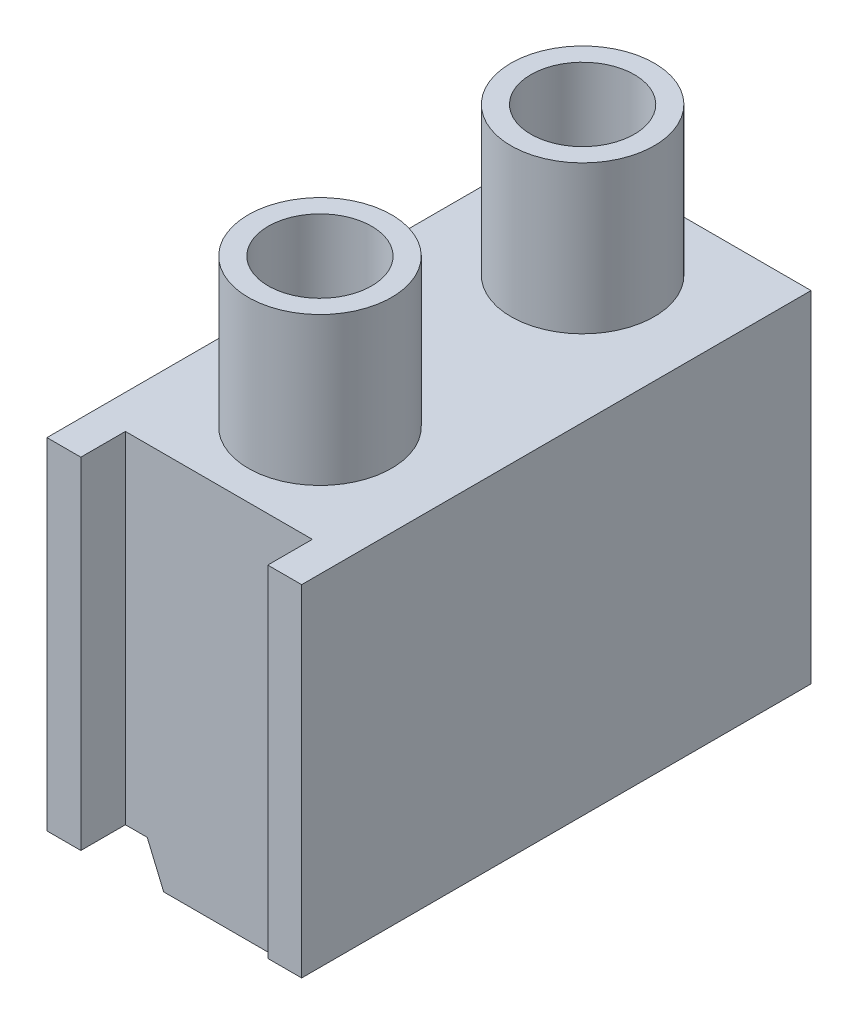
ISO-10303-21;
HEADER;
FILE_DESCRIPTION(('STEP AP214'),'2;1');
FILE_NAME('part.step','',(''),(''),'','','');
FILE_SCHEMA(('AUTOMOTIVE_DESIGN { 1 0 10303 214 1 1 1 1 }'));
ENDSEC;
DATA;
#1=APPLICATION_CONTEXT('core data for automotive mechanical design processes');
#2=APPLICATION_PROTOCOL_DEFINITION('international standard','automotive_design',2000,#1);
#3=PRODUCT_CONTEXT('',#1,'mechanical');
#4=PRODUCT('Part','Part','',(#3));
#5=PRODUCT_RELATED_PRODUCT_CATEGORY('part','',(#4));
#6=PRODUCT_DEFINITION_FORMATION('','',#4);
#7=PRODUCT_DEFINITION_CONTEXT('part definition',#1,'design');
#8=PRODUCT_DEFINITION('design','',#6,#7);
#9=PRODUCT_DEFINITION_SHAPE('','',#8);
#10=(LENGTH_UNIT() NAMED_UNIT(*) SI_UNIT(.MILLI.,.METRE.));
#11=(NAMED_UNIT(*) PLANE_ANGLE_UNIT() SI_UNIT($,.RADIAN.));
#12=(NAMED_UNIT(*) SI_UNIT($,.STERADIAN.) SOLID_ANGLE_UNIT());
#13=UNCERTAINTY_MEASURE_WITH_UNIT(LENGTH_MEASURE(1.E-05),#10,'distance_accuracy_value','');
#14=(GEOMETRIC_REPRESENTATION_CONTEXT(3) GLOBAL_UNCERTAINTY_ASSIGNED_CONTEXT((#13)) GLOBAL_UNIT_ASSIGNED_CONTEXT((#10,
#11,#12)) REPRESENTATION_CONTEXT('',''));
#15=CARTESIAN_POINT('',(0.,0.,0.));
#16=DIRECTION('',(0.,0.,1.));
#17=DIRECTION('',(1.,0.,0.));
#18=AXIS2_PLACEMENT_3D('',#15,#16,#17);
#19=CARTESIAN_POINT('',(0.,0.,32.));
#20=DIRECTION('',(0.,0.,1.));
#21=DIRECTION('',(1.,0.,0.));
#22=AXIS2_PLACEMENT_3D('',#19,#20,#21);
#23=PLANE('',#22);
#24=DIRECTION('',(0.,-1.,0.));
#25=VECTOR('',#24,1.);
#26=CARTESIAN_POINT('',(-13.87111125249,-113.2078554853,32.));
#27=LINE('',#26,#25);
#28=CARTESIAN_POINT('',(-13.87111125249,-113.2078554853,32.));
#29=VERTEX_POINT('',#28);
#30=CARTESIAN_POINT('',(-13.87111125249,-134.6078554853,32.));
#31=VERTEX_POINT('',#30);
#32=EDGE_CURVE('E25',#29,#31,#27,.T.);
#33=ORIENTED_EDGE('',*,*,#32,.F.);
#34=DIRECTION('',(-1.,0.,0.));
#35=VECTOR('',#34,1.);
#36=CARTESIAN_POINT('',(-13.87111125249,-113.2078554853,32.));
#37=LINE('',#36,#35);
#38=CARTESIAN_POINT('',(-16.,-113.2078554853,32.));
#39=VERTEX_POINT('',#38);
#40=EDGE_CURVE('E334',#29,#39,#37,.T.);
#41=ORIENTED_EDGE('',*,*,#40,.T.);
#42=DIRECTION('',(0.,-1.,0.));
#43=VECTOR('',#42,1.);
#44=CARTESIAN_POINT('',(-16.,-113.2078554853,32.));
#45=LINE('',#44,#43);
#46=CARTESIAN_POINT('',(-16.,-134.6078554853,32.));
#47=VERTEX_POINT('',#46);
#48=EDGE_CURVE('E37',#39,#47,#45,.T.);
#49=ORIENTED_EDGE('',*,*,#48,.T.);
#50=DIRECTION('',(1.,0.,0.));
#51=VECTOR('',#50,1.);
#52=CARTESIAN_POINT('',(-16.,-134.6078554853,32.));
#53=LINE('',#52,#51);
#54=EDGE_CURVE('E319',#47,#31,#53,.T.);
#55=ORIENTED_EDGE('',*,*,#54,.T.);
#56=EDGE_LOOP('',(#33,#41,#49,#55));
#57=FACE_BOUND('',#56,.T.);
#58=ADVANCED_FACE('F17',(#57),#23,.T.);
#59=CARTESIAN_POINT('',(0.,0.,32.));
#60=DIRECTION('',(0.,0.,1.));
#61=DIRECTION('',(1.,0.,0.));
#62=AXIS2_PLACEMENT_3D('',#59,#60,#61);
#63=PLANE('',#62);
#64=DIRECTION('',(0.,1.,0.));
#65=VECTOR('',#64,1.);
#66=CARTESIAN_POINT('',(-2.128888747504,-134.6078554853,32.));
#67=LINE('',#66,#65);
#68=CARTESIAN_POINT('',(-2.128888747504,-134.6078554853,32.));
#69=VERTEX_POINT('',#68);
#70=CARTESIAN_POINT('',(-2.128888747504,-113.2078554853,32.));
#71=VERTEX_POINT('',#70);
#72=EDGE_CURVE('E11',#69,#71,#67,.T.);
#73=ORIENTED_EDGE('',*,*,#72,.F.);
#74=DIRECTION('',(1.,0.,0.));
#75=VECTOR('',#74,1.);
#76=CARTESIAN_POINT('',(-2.128888747504,-134.6078554853,32.));
#77=LINE('',#76,#75);
#78=CARTESIAN_POINT('',(0.,-134.6078554853,32.));
#79=VERTEX_POINT('',#78);
#80=EDGE_CURVE('E350',#69,#79,#77,.T.);
#81=ORIENTED_EDGE('',*,*,#80,.T.);
#82=DIRECTION('',(0.,1.,0.));
#83=VECTOR('',#82,1.);
#84=CARTESIAN_POINT('',(0.,-134.6078554853,32.));
#85=LINE('',#84,#83);
#86=CARTESIAN_POINT('',(0.,-113.2078554853,32.));
#87=VERTEX_POINT('',#86);
#88=EDGE_CURVE('E340',#79,#87,#85,.T.);
#89=ORIENTED_EDGE('',*,*,#88,.T.);
#90=DIRECTION('',(-1.,0.,0.));
#91=VECTOR('',#90,1.);
#92=CARTESIAN_POINT('',(0.,-113.2078554853,32.));
#93=LINE('',#92,#91);
#94=EDGE_CURVE('E322',#87,#71,#93,.T.);
#95=ORIENTED_EDGE('',*,*,#94,.T.);
#96=EDGE_LOOP('',(#73,#81,#89,#95));
#97=FACE_BOUND('',#96,.T.);
#98=ADVANCED_FACE('F695',(#97),#63,.T.);
#99=CARTESIAN_POINT('',(-2.128888747504,-143.2078554853,32.));
#100=DIRECTION('',(1.,0.,0.));
#101=DIRECTION('',(0.,1.,0.));
#102=AXIS2_PLACEMENT_3D('',#99,#100,#101);
#103=PLANE('',#102);
#104=DIRECTION('',(0.,0.,-1.));
#105=VECTOR('',#104,1.);
#106=CARTESIAN_POINT('',(-2.128888747504,-113.2078554853,32.));
#107=LINE('',#106,#105);
#108=CARTESIAN_POINT('',(-2.128888747504,-113.2078554853,29.2));
#109=VERTEX_POINT('',#108);
#110=EDGE_CURVE('E227',#71,#109,#107,.T.);
#111=ORIENTED_EDGE('',*,*,#110,.T.);
#112=DIRECTION('',(0.,1.,0.));
#113=VECTOR('',#112,1.);
#114=CARTESIAN_POINT('',(-2.128888747504,-134.6078554853,29.2));
#115=LINE('',#114,#113);
#116=CARTESIAN_POINT('',(-2.128888747504,-134.6078554853,29.2));
#117=VERTEX_POINT('',#116);
#118=EDGE_CURVE('E228',#117,#109,#115,.T.);
#119=ORIENTED_EDGE('',*,*,#118,.F.);
#120=DIRECTION('',(0.,0.,1.));
#121=VECTOR('',#120,1.);
#122=CARTESIAN_POINT('',(-2.128888747504,-134.6078554853,29.2));
#123=LINE('',#122,#121);
#124=EDGE_CURVE('E353',#117,#69,#123,.T.);
#125=ORIENTED_EDGE('',*,*,#124,.T.);
#126=ORIENTED_EDGE('',*,*,#72,.T.);
#127=EDGE_LOOP('',(#111,#119,#125,#126));
#128=FACE_BOUND('',#127,.T.);
#129=ADVANCED_FACE('F685',(#128),#103,.F.);
#130=CARTESIAN_POINT('',(-13.87111125249,-143.2078554853,29.2));
#131=DIRECTION('',(-1.,0.,0.));
#132=DIRECTION('',(0.,0.,1.));
#133=AXIS2_PLACEMENT_3D('',#130,#131,#132);
#134=PLANE('',#133);
#135=DIRECTION('',(0.,0.,1.));
#136=VECTOR('',#135,1.);
#137=CARTESIAN_POINT('',(-13.87111125249,-113.2078554853,29.2));
#138=LINE('',#137,#136);
#139=CARTESIAN_POINT('',(-13.87111125249,-113.2078554853,29.2));
#140=VERTEX_POINT('',#139);
#141=EDGE_CURVE('E337',#140,#29,#138,.T.);
#142=ORIENTED_EDGE('',*,*,#141,.T.);
#143=ORIENTED_EDGE('',*,*,#32,.T.);
#144=DIRECTION('',(0.,0.,-1.));
#145=VECTOR('',#144,1.);
#146=CARTESIAN_POINT('',(-13.87111125249,-134.6078554853,32.));
#147=LINE('',#146,#145);
#148=CARTESIAN_POINT('',(-13.87111125249,-134.6078554853,29.2));
#149=VERTEX_POINT('',#148);
#150=EDGE_CURVE('E346',#31,#149,#147,.T.);
#151=ORIENTED_EDGE('',*,*,#150,.T.);
#152=DIRECTION('',(0.,1.,0.));
#153=VECTOR('',#152,1.);
#154=CARTESIAN_POINT('',(-13.87111125249,-134.6078554853,29.2));
#155=LINE('',#154,#153);
#156=EDGE_CURVE('E234',#149,#140,#155,.T.);
#157=ORIENTED_EDGE('',*,*,#156,.T.);
#158=EDGE_LOOP('',(#142,#143,#151,#157));
#159=FACE_BOUND('',#158,.T.);
#160=ADVANCED_FACE('F675',(#159),#134,.F.);
#161=CARTESIAN_POINT('',(-16.,-113.2078554853,0.));
#162=DIRECTION('',(-1.,0.,0.));
#163=DIRECTION('',(0.,0.,1.));
#164=AXIS2_PLACEMENT_3D('',#161,#162,#163);
#165=PLANE('',#164);
#166=DIRECTION('',(0.,-1.,0.));
#167=VECTOR('',#166,1.);
#168=CARTESIAN_POINT('',(-16.,-113.2078554853,0.));
#169=LINE('',#168,#167);
#170=CARTESIAN_POINT('',(-16.,-113.2078554853,0.));
#171=VERTEX_POINT('',#170);
#172=CARTESIAN_POINT('',(-16.,-134.6078554853,0.));
#173=VERTEX_POINT('',#172);
#174=EDGE_CURVE('E285',#171,#173,#169,.T.);
#175=ORIENTED_EDGE('',*,*,#174,.T.);
#176=DIRECTION('',(0.,0.,1.));
#177=VECTOR('',#176,1.);
#178=CARTESIAN_POINT('',(-16.,-134.6078554853,0.));
#179=LINE('',#178,#177);
#180=EDGE_CURVE('E190',#173,#47,#179,.T.);
#181=ORIENTED_EDGE('',*,*,#180,.T.);
#182=ORIENTED_EDGE('',*,*,#48,.F.);
#183=DIRECTION('',(0.,0.,1.));
#184=VECTOR('',#183,1.);
#185=CARTESIAN_POINT('',(-16.,-113.2078554853,0.));
#186=LINE('',#185,#184);
#187=EDGE_CURVE('E330',#171,#39,#186,.T.);
#188=ORIENTED_EDGE('',*,*,#187,.F.);
#189=EDGE_LOOP('',(#175,#181,#182,#188));
#190=FACE_BOUND('',#189,.T.);
#191=ADVANCED_FACE('F665',(#190),#165,.T.);
#192=CARTESIAN_POINT('',(-16.,-134.6078554853,0.));
#193=DIRECTION('',(0.,-1.,0.));
#194=DIRECTION('',(0.,0.,-1.));
#195=AXIS2_PLACEMENT_3D('',#192,#193,#194);
#196=PLANE('',#195);
#197=DIRECTION('',(0.,0.,-1.));
#198=VECTOR('',#197,1.);
#199=CARTESIAN_POINT('',(-12.50098616425,-134.6078554853,29.2));
#200=LINE('',#199,#198);
#201=CARTESIAN_POINT('',(-12.50098616425,-134.6078554853,29.2));
#202=VERTEX_POINT('',#201);
#203=CARTESIAN_POINT('',(-12.50098616425,-134.6078554853,0.));
#204=VERTEX_POINT('',#203);
#205=EDGE_CURVE('E224',#202,#204,#200,.T.);
#206=ORIENTED_EDGE('',*,*,#205,.F.);
#207=DIRECTION('',(1.,0.,0.));
#208=VECTOR('',#207,1.);
#209=CARTESIAN_POINT('',(-13.87111125249,-134.6078554853,29.2));
#210=LINE('',#209,#208);
#211=EDGE_CURVE('E229',#149,#202,#210,.T.);
#212=ORIENTED_EDGE('',*,*,#211,.F.);
#213=ORIENTED_EDGE('',*,*,#150,.F.);
#214=ORIENTED_EDGE('',*,*,#54,.F.);
#215=ORIENTED_EDGE('',*,*,#180,.F.);
#216=DIRECTION('',(1.,0.,0.));
#217=VECTOR('',#216,1.);
#218=CARTESIAN_POINT('',(-16.,-134.6078554853,0.));
#219=LINE('',#218,#217);
#220=EDGE_CURVE('E281',#173,#204,#219,.T.);
#221=ORIENTED_EDGE('',*,*,#220,.T.);
#222=EDGE_LOOP('',(#206,#212,#213,#214,#215,#221));
#223=FACE_BOUND('',#222,.T.);
#224=ADVANCED_FACE('F654',(#223),#196,.T.);
#225=CARTESIAN_POINT('',(-16.,-134.6078554853,0.));
#226=DIRECTION('',(0.,-1.,0.));
#227=DIRECTION('',(0.,0.,-1.));
#228=AXIS2_PLACEMENT_3D('',#225,#226,#227);
#229=PLANE('',#228);
#230=DIRECTION('',(0.,0.,1.));
#231=VECTOR('',#230,1.);
#232=CARTESIAN_POINT('',(-3.499013835749,-134.6078554853,0.));
#233=LINE('',#232,#231);
#234=CARTESIAN_POINT('',(-3.499013835749,-134.6078554853,0.));
#235=VERTEX_POINT('',#234);
#236=CARTESIAN_POINT('',(-3.499013835749,-134.6078554853,29.2));
#237=VERTEX_POINT('',#236);
#238=EDGE_CURVE('E297',#235,#237,#233,.T.);
#239=ORIENTED_EDGE('',*,*,#238,.F.);
#240=DIRECTION('',(1.,0.,0.));
#241=VECTOR('',#240,1.);
#242=CARTESIAN_POINT('',(-3.499013835749,-134.6078554853,0.));
#243=LINE('',#242,#241);
#244=CARTESIAN_POINT('',(0.,-134.6078554853,0.));
#245=VERTEX_POINT('',#244);
#246=EDGE_CURVE('E263',#235,#245,#243,.T.);
#247=ORIENTED_EDGE('',*,*,#246,.T.);
#248=DIRECTION('',(0.,0.,1.));
#249=VECTOR('',#248,1.);
#250=CARTESIAN_POINT('',(0.,-134.6078554853,0.));
#251=LINE('',#250,#249);
#252=EDGE_CURVE('E343',#245,#79,#251,.T.);
#253=ORIENTED_EDGE('',*,*,#252,.T.);
#254=ORIENTED_EDGE('',*,*,#80,.F.);
#255=ORIENTED_EDGE('',*,*,#124,.F.);
#256=DIRECTION('',(1.,0.,0.));
#257=VECTOR('',#256,1.);
#258=CARTESIAN_POINT('',(-3.499013835749,-134.6078554853,29.2));
#259=LINE('',#258,#257);
#260=EDGE_CURVE('E310',#237,#117,#259,.T.);
#261=ORIENTED_EDGE('',*,*,#260,.F.);
#262=EDGE_LOOP('',(#239,#247,#253,#254,#255,#261));
#263=FACE_BOUND('',#262,.T.);
#264=ADVANCED_FACE('F644',(#263),#229,.T.);
#265=CARTESIAN_POINT('',(0.,-134.6078554853,0.));
#266=DIRECTION('',(1.,0.,0.));
#267=DIRECTION('',(0.,-1.,0.));
#268=AXIS2_PLACEMENT_3D('',#265,#266,#267);
#269=PLANE('',#268);
#270=DIRECTION('',(0.,1.,0.));
#271=VECTOR('',#270,1.);
#272=CARTESIAN_POINT('',(0.,-134.6078554853,0.));
#273=LINE('',#272,#271);
#274=CARTESIAN_POINT('',(0.,-113.2078554853,0.));
#275=VERTEX_POINT('',#274);
#276=EDGE_CURVE('E256',#245,#275,#273,.T.);
#277=ORIENTED_EDGE('',*,*,#276,.T.);
#278=DIRECTION('',(0.,0.,1.));
#279=VECTOR('',#278,1.);
#280=CARTESIAN_POINT('',(0.,-113.2078554853,0.));
#281=LINE('',#280,#279);
#282=EDGE_CURVE('E326',#275,#87,#281,.T.);
#283=ORIENTED_EDGE('',*,*,#282,.T.);
#284=ORIENTED_EDGE('',*,*,#88,.F.);
#285=ORIENTED_EDGE('',*,*,#252,.F.);
#286=EDGE_LOOP('',(#277,#283,#284,#285));
#287=FACE_BOUND('',#286,.T.);
#288=ADVANCED_FACE('F632',(#287),#269,.T.);
#289=CARTESIAN_POINT('',(0.,-113.2078554853,0.));
#290=DIRECTION('',(0.,1.,0.));
#291=DIRECTION('',(1.,0.,0.));
#292=AXIS2_PLACEMENT_3D('',#289,#290,#291);
#293=PLANE('',#292);
#294=CARTESIAN_POINT('',(-8.,-113.2078554853,22.85));
#295=DIRECTION('',(0.,1.,0.));
#296=DIRECTION('',(-1.,0.,0.));
#297=AXIS2_PLACEMENT_3D('',#294,#295,#296);
#298=CIRCLE('',#297,4.5);
#299=CARTESIAN_POINT('',(-12.5,-113.2078554853,22.85));
#300=VERTEX_POINT('',#299);
#301=EDGE_CURVE('E171',#300,#300,#298,.T.);
#302=ORIENTED_EDGE('',*,*,#301,.F.);
#303=EDGE_LOOP('',(#302));
#304=FACE_BOUND('',#303,.T.);
#305=CARTESIAN_POINT('',(-8.,-113.2078554853,6.35));
#306=DIRECTION('',(0.,1.,0.));
#307=DIRECTION('',(-1.,0.,0.));
#308=AXIS2_PLACEMENT_3D('',#305,#306,#307);
#309=CIRCLE('',#308,4.5);
#310=CARTESIAN_POINT('',(-12.5,-113.2078554853,6.35));
#311=VERTEX_POINT('',#310);
#312=EDGE_CURVE('E250',#311,#311,#309,.T.);
#313=ORIENTED_EDGE('',*,*,#312,.F.);
#314=EDGE_LOOP('',(#313));
#315=FACE_BOUND('',#314,.T.);
#316=ORIENTED_EDGE('',*,*,#110,.F.);
#317=ORIENTED_EDGE('',*,*,#94,.F.);
#318=ORIENTED_EDGE('',*,*,#282,.F.);
#319=DIRECTION('',(-1.,0.,0.));
#320=VECTOR('',#319,1.);
#321=CARTESIAN_POINT('',(0.,-113.2078554853,0.));
#322=LINE('',#321,#320);
#323=EDGE_CURVE('E293',#275,#171,#322,.T.);
#324=ORIENTED_EDGE('',*,*,#323,.T.);
#325=ORIENTED_EDGE('',*,*,#187,.T.);
#326=ORIENTED_EDGE('',*,*,#40,.F.);
#327=ORIENTED_EDGE('',*,*,#141,.F.);
#328=DIRECTION('',(-1.,0.,0.));
#329=VECTOR('',#328,1.);
#330=CARTESIAN_POINT('',(-2.128888747504,-113.2078554853,29.2));
#331=LINE('',#330,#329);
#332=EDGE_CURVE('E289',#109,#140,#331,.T.);
#333=ORIENTED_EDGE('',*,*,#332,.F.);
#334=EDGE_LOOP('',(#316,#317,#318,#324,#325,#326,#327,#333));
#335=FACE_BOUND('',#334,.T.);
#336=ADVANCED_FACE('F620',(#304,#315,#335),#293,.T.);
#337=CARTESIAN_POINT('',(-12.50098616425,-134.6078554853,-1.));
#338=DIRECTION('',(-0.921115827107869,-0.389288624353945,0.));
#339=DIRECTION('',(-0.389288624353945,0.921115827107869,0.));
#340=AXIS2_PLACEMENT_3D('',#337,#338,#339);
#341=PLANE('',#340);
#342=ORIENTED_EDGE('',*,*,#205,.T.);
#343=DIRECTION('',(0.389288624353945,-0.921115827107869,0.));
#344=VECTOR('',#343,1.);
#345=CARTESIAN_POINT('',(-12.50098616425,-134.6078554853,0.));
#346=LINE('',#345,#344);
#347=CARTESIAN_POINT('',(-11.46554946715,-137.0578554853,0.));
#348=VERTEX_POINT('',#347);
#349=EDGE_CURVE('E262',#204,#348,#346,.T.);
#350=ORIENTED_EDGE('',*,*,#349,.T.);
#351=DIRECTION('',(0.,0.,1.));
#352=VECTOR('',#351,1.);
#353=CARTESIAN_POINT('',(-11.46554946715,-137.0578554853,0.));
#354=LINE('',#353,#352);
#355=CARTESIAN_POINT('',(-11.46554946715,-137.0578554853,29.2));
#356=VERTEX_POINT('',#355);
#357=EDGE_CURVE('E211',#348,#356,#354,.T.);
#358=ORIENTED_EDGE('',*,*,#357,.T.);
#359=DIRECTION('',(0.389288624353945,-0.921115827107869,0.));
#360=VECTOR('',#359,1.);
#361=CARTESIAN_POINT('',(-12.50098616425,-134.6078554853,29.2));
#362=LINE('',#361,#360);
#363=EDGE_CURVE('E233',#202,#356,#362,.T.);
#364=ORIENTED_EDGE('',*,*,#363,.F.);
#365=EDGE_LOOP('',(#342,#350,#358,#364));
#366=FACE_BOUND('',#365,.T.);
#367=ADVANCED_FACE('F609',(#366),#341,.T.);
#368=CARTESIAN_POINT('',(-2.128888747504,-143.2078554853,29.2));
#369=DIRECTION('',(0.,0.,-1.));
#370=DIRECTION('',(0.,-1.,0.));
#371=AXIS2_PLACEMENT_3D('',#368,#369,#370);
#372=PLANE('',#371);
#373=ORIENTED_EDGE('',*,*,#332,.T.);
#374=ORIENTED_EDGE('',*,*,#156,.F.);
#375=ORIENTED_EDGE('',*,*,#211,.T.);
#376=ORIENTED_EDGE('',*,*,#363,.T.);
#377=DIRECTION('',(1.,0.,0.));
#378=VECTOR('',#377,1.);
#379=CARTESIAN_POINT('',(-11.46554946715,-137.0578554853,29.2));
#380=LINE('',#379,#378);
#381=CARTESIAN_POINT('',(-4.53445053285,-137.0578554853,29.2));
#382=VERTEX_POINT('',#381);
#383=EDGE_CURVE('E223',#356,#382,#380,.T.);
#384=ORIENTED_EDGE('',*,*,#383,.T.);
#385=DIRECTION('',(0.389288624353945,0.921115827107869,0.));
#386=VECTOR('',#385,1.);
#387=CARTESIAN_POINT('',(-4.53445053285,-137.0578554853,29.2));
#388=LINE('',#387,#386);
#389=EDGE_CURVE('E301',#382,#237,#388,.T.);
#390=ORIENTED_EDGE('',*,*,#389,.T.);
#391=ORIENTED_EDGE('',*,*,#260,.T.);
#392=ORIENTED_EDGE('',*,*,#118,.T.);
#393=EDGE_LOOP('',(#373,#374,#375,#376,#384,#390,#391,#392));
#394=FACE_BOUND('',#393,.T.);
#395=ADVANCED_FACE('F598',(#394),#372,.F.);
#396=CARTESIAN_POINT('',(-4.53445053285,-137.0578554853,-1.));
#397=DIRECTION('',(0.921115827107869,-0.389288624353945,0.));
#398=DIRECTION('',(0.,0.,-1.));
#399=AXIS2_PLACEMENT_3D('',#396,#397,#398);
#400=PLANE('',#399);
#401=ORIENTED_EDGE('',*,*,#238,.T.);
#402=ORIENTED_EDGE('',*,*,#389,.F.);
#403=DIRECTION('',(0.,0.,1.));
#404=VECTOR('',#403,1.);
#405=CARTESIAN_POINT('',(-4.53445053285,-137.0578554853,0.));
#406=LINE('',#405,#404);
#407=CARTESIAN_POINT('',(-4.53445053285,-137.0578554853,0.));
#408=VERTEX_POINT('',#407);
#409=EDGE_CURVE('E219',#408,#382,#406,.T.);
#410=ORIENTED_EDGE('',*,*,#409,.F.);
#411=DIRECTION('',(0.389288624353945,0.921115827107869,0.));
#412=VECTOR('',#411,1.);
#413=CARTESIAN_POINT('',(-4.53445053285,-137.0578554853,0.));
#414=LINE('',#413,#412);
#415=EDGE_CURVE('E258',#408,#235,#414,.T.);
#416=ORIENTED_EDGE('',*,*,#415,.T.);
#417=EDGE_LOOP('',(#401,#402,#410,#416));
#418=FACE_BOUND('',#417,.T.);
#419=ADVANCED_FACE('F587',(#418),#400,.T.);
#420=CARTESIAN_POINT('',(0.,0.,0.));
#421=DIRECTION('',(0.,0.,1.));
#422=DIRECTION('',(1.,0.,0.));
#423=AXIS2_PLACEMENT_3D('',#420,#421,#422);
#424=PLANE('',#423);
#425=ORIENTED_EDGE('',*,*,#276,.F.);
#426=ORIENTED_EDGE('',*,*,#246,.F.);
#427=ORIENTED_EDGE('',*,*,#415,.F.);
#428=DIRECTION('',(1.,0.,0.));
#429=VECTOR('',#428,1.);
#430=CARTESIAN_POINT('',(-11.46554946715,-137.0578554853,0.));
#431=LINE('',#430,#429);
#432=EDGE_CURVE('E215',#348,#408,#431,.T.);
#433=ORIENTED_EDGE('',*,*,#432,.F.);
#434=ORIENTED_EDGE('',*,*,#349,.F.);
#435=ORIENTED_EDGE('',*,*,#220,.F.);
#436=ORIENTED_EDGE('',*,*,#174,.F.);
#437=ORIENTED_EDGE('',*,*,#323,.F.);
#438=EDGE_LOOP('',(#425,#426,#427,#433,#434,#435,#436,#437));
#439=FACE_BOUND('',#438,.T.);
#440=ADVANCED_FACE('F577',(#439),#424,.F.);
#441=CARTESIAN_POINT('',(-8.,-113.2078554853,6.35));
#442=DIRECTION('',(0.,1.,0.));
#443=DIRECTION('',(-1.,0.,0.));
#444=AXIS2_PLACEMENT_3D('',#441,#442,#443);
#445=CYLINDRICAL_SURFACE('',#444,4.5);
#446=CARTESIAN_POINT('',(-8.,-103.9078554853,6.35));
#447=DIRECTION('',(0.,1.,0.));
#448=DIRECTION('',(-1.,0.,0.));
#449=AXIS2_PLACEMENT_3D('',#446,#447,#448);
#450=CIRCLE('',#449,4.5);
#451=CARTESIAN_POINT('',(-12.5,-103.9078554853,6.35));
#452=VERTEX_POINT('',#451);
#453=EDGE_CURVE('E185',#452,#452,#450,.T.);
#454=ORIENTED_EDGE('',*,*,#453,.F.);
#455=CARTESIAN_POINT('',(-12.5,-113.2078554853,6.35));
#456=CARTESIAN_POINT('',(-12.5,-103.9078554853,6.35));
#457=(BOUNDED_CURVE() B_SPLINE_CURVE(1,(#455,#456),.UNSPECIFIED.,.F.,
.F.) B_SPLINE_CURVE_WITH_KNOTS((2,2),(0.,9.3),
.UNSPECIFIED.) CURVE() GEOMETRIC_REPRESENTATION_ITEM() RATIONAL_B_SPLINE_CURVE((1.,1.)) REPRESENTATION_ITEM(''));
#458=EDGE_CURVE('E257',#311,#452,#457,.T.);
#459=ORIENTED_EDGE('',*,*,#458,.F.);
#460=ORIENTED_EDGE('',*,*,#312,.T.);
#461=ORIENTED_EDGE('',*,*,#458,.T.);
#462=EDGE_LOOP('',(#454,#459,#460,#461));
#463=FACE_BOUND('',#462,.T.);
#464=ADVANCED_FACE('F567',(#463),#445,.T.);
#465=CARTESIAN_POINT('',(-8.,-113.2078554853,22.85));
#466=DIRECTION('',(0.,1.,0.));
#467=DIRECTION('',(-1.,0.,0.));
#468=AXIS2_PLACEMENT_3D('',#465,#466,#467);
#469=CYLINDRICAL_SURFACE('',#468,4.5);
#470=CARTESIAN_POINT('',(-8.,-103.9078554853,22.85));
#471=DIRECTION('',(0.,1.,0.));
#472=DIRECTION('',(-1.,0.,0.));
#473=AXIS2_PLACEMENT_3D('',#470,#471,#472);
#474=CIRCLE('',#473,4.5);
#475=CARTESIAN_POINT('',(-12.5,-103.9078554853,22.85));
#476=VERTEX_POINT('',#475);
#477=EDGE_CURVE('E169',#476,#476,#474,.T.);
#478=ORIENTED_EDGE('',*,*,#477,.F.);
#479=CARTESIAN_POINT('',(-12.5,-113.2078554853,22.85));
#480=CARTESIAN_POINT('',(-12.5,-103.9078554853,22.85));
#481=(BOUNDED_CURVE() B_SPLINE_CURVE(1,(#479,#480),.UNSPECIFIED.,.F.,
.F.) B_SPLINE_CURVE_WITH_KNOTS((2,2),(0.,9.3),
.UNSPECIFIED.) CURVE() GEOMETRIC_REPRESENTATION_ITEM() RATIONAL_B_SPLINE_CURVE((1.,1.)) REPRESENTATION_ITEM(''));
#482=EDGE_CURVE('E166',#300,#476,#481,.T.);
#483=ORIENTED_EDGE('',*,*,#482,.F.);
#484=ORIENTED_EDGE('',*,*,#301,.T.);
#485=ORIENTED_EDGE('',*,*,#482,.T.);
#486=EDGE_LOOP('',(#478,#483,#484,#485));
#487=FACE_BOUND('',#486,.T.);
#488=ADVANCED_FACE('F168',(#487),#469,.T.);
#489=CARTESIAN_POINT('',(-8.,-137.9078554853,22.85));
#490=DIRECTION('',(0.,1.,0.));
#491=DIRECTION('',(-1.,0.,0.));
#492=AXIS2_PLACEMENT_3D('',#489,#490,#491);
#493=CYLINDRICAL_SURFACE('',#492,3.25);
#494=CARTESIAN_POINT('',(-11.25,-137.0578554853,22.85));
#495=CARTESIAN_POINT('',(-11.25,-103.9078554853,22.85));
#496=(BOUNDED_CURVE() B_SPLINE_CURVE(1,(#494,#495),.UNSPECIFIED.,.F.,
.F.) B_SPLINE_CURVE_WITH_KNOTS((2,2),(0.85,34.),
.UNSPECIFIED.) CURVE() GEOMETRIC_REPRESENTATION_ITEM() RATIONAL_B_SPLINE_CURVE((1.,1.)) REPRESENTATION_ITEM(''));
#497=CARTESIAN_POINT('',(-11.25,-137.0578554853,22.85));
#498=VERTEX_POINT('',#497);
#499=CARTESIAN_POINT('',(-11.25,-103.9078554853,22.85));
#500=VERTEX_POINT('',#499);
#501=EDGE_CURVE('E173',#498,#500,#496,.T.);
#502=ORIENTED_EDGE('',*,*,#501,.F.);
#503=CARTESIAN_POINT('',(-8.,-137.0578554853,22.85));
#504=DIRECTION('',(0.,1.,0.));
#505=DIRECTION('',(-1.,0.,0.));
#506=AXIS2_PLACEMENT_3D('',#503,#504,#505);
#507=CIRCLE('',#506,3.25);
#508=EDGE_CURVE('E202',#498,#498,#507,.T.);
#509=ORIENTED_EDGE('',*,*,#508,.F.);
#510=ORIENTED_EDGE('',*,*,#501,.T.);
#511=CARTESIAN_POINT('',(-8.,-103.9078554853,22.85));
#512=DIRECTION('',(0.,1.,0.));
#513=DIRECTION('',(-1.,0.,0.));
#514=AXIS2_PLACEMENT_3D('',#511,#512,#513);
#515=CIRCLE('',#514,3.25);
#516=EDGE_CURVE('E178',#500,#500,#515,.T.);
#517=ORIENTED_EDGE('',*,*,#516,.T.);
#518=EDGE_LOOP('',(#502,#509,#510,#517));
#519=FACE_BOUND('',#518,.T.);
#520=ADVANCED_FACE('F547',(#519),#493,.F.);
#521=CARTESIAN_POINT('',(-8.,-137.9078554853,6.35));
#522=DIRECTION('',(0.,1.,0.));
#523=DIRECTION('',(-1.,0.,0.));
#524=AXIS2_PLACEMENT_3D('',#521,#522,#523);
#525=CYLINDRICAL_SURFACE('',#524,3.25);
#526=CARTESIAN_POINT('',(-11.25,-137.0578554853,6.35));
#527=CARTESIAN_POINT('',(-11.25,-103.9078554853,6.35));
#528=(BOUNDED_CURVE() B_SPLINE_CURVE(1,(#526,#527),.UNSPECIFIED.,.F.,
.F.) B_SPLINE_CURVE_WITH_KNOTS((2,2),(0.85,34.),
.UNSPECIFIED.) CURVE() GEOMETRIC_REPRESENTATION_ITEM() RATIONAL_B_SPLINE_CURVE((1.,1.)) REPRESENTATION_ITEM(''));
#529=CARTESIAN_POINT('',(-11.25,-137.0578554853,6.35));
#530=VERTEX_POINT('',#529);
#531=CARTESIAN_POINT('',(-11.25,-103.9078554853,6.35));
#532=VERTEX_POINT('',#531);
#533=EDGE_CURVE('E195',#530,#532,#528,.T.);
#534=ORIENTED_EDGE('',*,*,#533,.F.);
#535=CARTESIAN_POINT('',(-8.,-137.0578554853,6.35));
#536=DIRECTION('',(0.,1.,0.));
#537=DIRECTION('',(-1.,0.,0.));
#538=AXIS2_PLACEMENT_3D('',#535,#536,#537);
#539=CIRCLE('',#538,3.25);
#540=EDGE_CURVE('E196',#530,#530,#539,.T.);
#541=ORIENTED_EDGE('',*,*,#540,.F.);
#542=ORIENTED_EDGE('',*,*,#533,.T.);
#543=CARTESIAN_POINT('',(-8.,-103.9078554853,6.35));
#544=DIRECTION('',(0.,1.,0.));
#545=DIRECTION('',(-1.,0.,0.));
#546=AXIS2_PLACEMENT_3D('',#543,#544,#545);
#547=CIRCLE('',#546,3.25);
#548=EDGE_CURVE('E207',#532,#532,#547,.T.);
#549=ORIENTED_EDGE('',*,*,#548,.T.);
#550=EDGE_LOOP('',(#534,#541,#542,#549));
#551=FACE_BOUND('',#550,.T.);
#552=ADVANCED_FACE('F536',(#551),#525,.F.);
#553=CARTESIAN_POINT('',(-11.46554946715,-137.0578554853,-1.));
#554=DIRECTION('',(0.,-1.,0.));
#555=DIRECTION('',(0.,0.,-1.));
#556=AXIS2_PLACEMENT_3D('',#553,#554,#555);
#557=PLANE('',#556);
#558=ORIENTED_EDGE('',*,*,#540,.T.);
#559=EDGE_LOOP('',(#558));
#560=FACE_BOUND('',#559,.T.);
#561=ORIENTED_EDGE('',*,*,#508,.T.);
#562=EDGE_LOOP('',(#561));
#563=FACE_BOUND('',#562,.T.);
#564=ORIENTED_EDGE('',*,*,#432,.T.);
#565=ORIENTED_EDGE('',*,*,#409,.T.);
#566=ORIENTED_EDGE('',*,*,#383,.F.);
#567=ORIENTED_EDGE('',*,*,#357,.F.);
#568=EDGE_LOOP('',(#564,#565,#566,#567));
#569=FACE_BOUND('',#568,.T.);
#570=ADVANCED_FACE('F523',(#560,#563,#569),#557,.T.);
#571=CARTESIAN_POINT('',(0.,-103.9078554853,0.));
#572=DIRECTION('',(0.,1.,0.));
#573=DIRECTION('',(1.,0.,0.));
#574=AXIS2_PLACEMENT_3D('',#571,#572,#573);
#575=PLANE('',#574);
#576=ORIENTED_EDGE('',*,*,#548,.F.);
#577=EDGE_LOOP('',(#576));
#578=FACE_BOUND('',#577,.T.);
#579=ORIENTED_EDGE('',*,*,#453,.T.);
#580=EDGE_LOOP('',(#579));
#581=FACE_BOUND('',#580,.T.);
#582=ADVANCED_FACE('F510',(#578,#581),#575,.T.);
#583=CARTESIAN_POINT('',(0.,-103.9078554853,0.));
#584=DIRECTION('',(0.,1.,0.));
#585=DIRECTION('',(1.,0.,0.));
#586=AXIS2_PLACEMENT_3D('',#583,#584,#585);
#587=PLANE('',#586);
#588=ORIENTED_EDGE('',*,*,#516,.F.);
#589=EDGE_LOOP('',(#588));
#590=FACE_BOUND('',#589,.T.);
#591=ORIENTED_EDGE('',*,*,#477,.T.);
#592=EDGE_LOOP('',(#591));
#593=FACE_BOUND('',#592,.T.);
#594=ADVANCED_FACE('F176',(#590,#593),#587,.T.);
#595=CLOSED_SHELL('',(#58,#98,#129,#160,#191,#224,#264,#288,#336,#367,#395,#419,#440,#464,#488,
#520,#552,#570,#582,#594));
#596=MANIFOLD_SOLID_BREP('B1',#595);
#597=ADVANCED_BREP_SHAPE_REPRESENTATION('',(#18,#596),#14);
#598=SHAPE_DEFINITION_REPRESENTATION(#9,#597);
ENDSEC;
END-ISO-10303-21;
